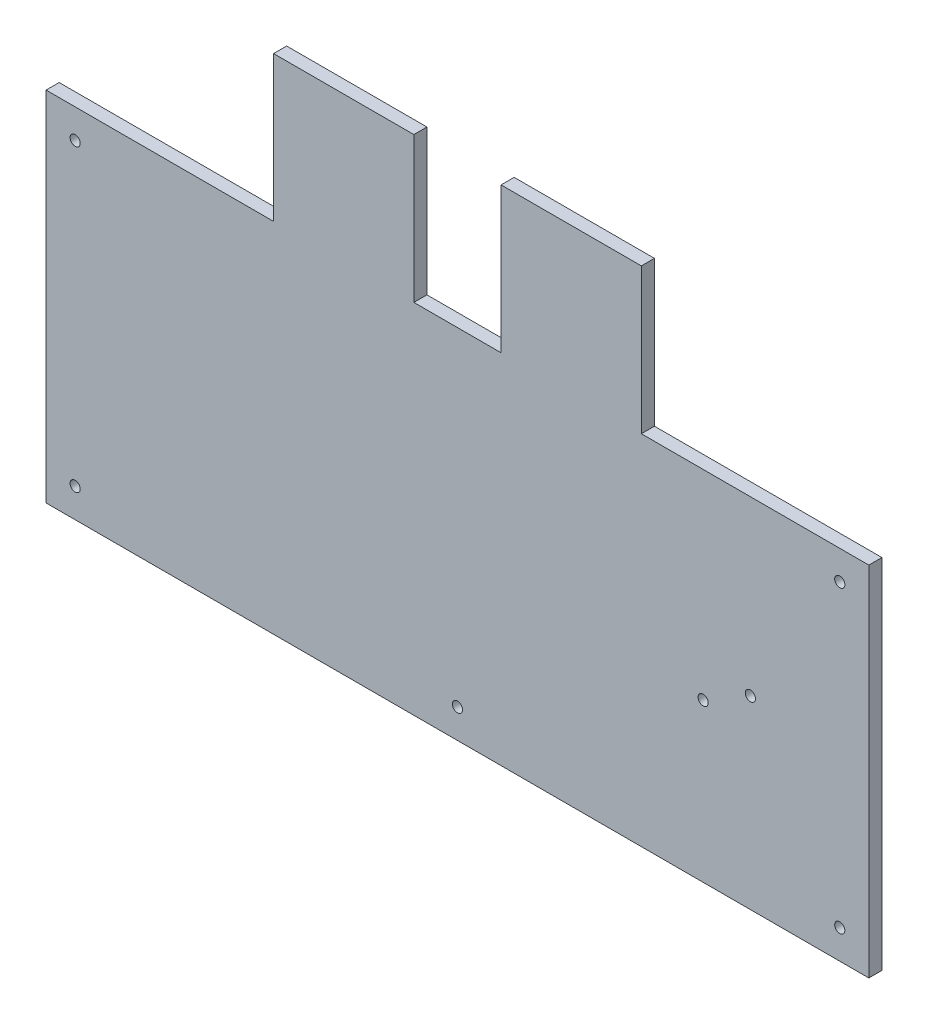
ISO-10303-21;
HEADER;
FILE_DESCRIPTION(('STEP AP214'),'2;1');
FILE_NAME('part.step','',(''),(''),'','','');
FILE_SCHEMA(('AUTOMOTIVE_DESIGN { 1 0 10303 214 1 1 1 1 }'));
ENDSEC;
DATA;
#1=APPLICATION_CONTEXT('core data for automotive mechanical design processes');
#2=APPLICATION_PROTOCOL_DEFINITION('international standard','automotive_design',2000,#1);
#3=PRODUCT_CONTEXT('',#1,'mechanical');
#4=PRODUCT('Part','Part','',(#3));
#5=PRODUCT_RELATED_PRODUCT_CATEGORY('part','',(#4));
#6=PRODUCT_DEFINITION_FORMATION('','',#4);
#7=PRODUCT_DEFINITION_CONTEXT('part definition',#1,'design');
#8=PRODUCT_DEFINITION('design','',#6,#7);
#9=PRODUCT_DEFINITION_SHAPE('','',#8);
#10=(LENGTH_UNIT() NAMED_UNIT(*) SI_UNIT(.MILLI.,.METRE.));
#11=(NAMED_UNIT(*) PLANE_ANGLE_UNIT() SI_UNIT($,.RADIAN.));
#12=(NAMED_UNIT(*) SI_UNIT($,.STERADIAN.) SOLID_ANGLE_UNIT());
#13=UNCERTAINTY_MEASURE_WITH_UNIT(LENGTH_MEASURE(1.E-05),#10,'distance_accuracy_value','');
#14=(GEOMETRIC_REPRESENTATION_CONTEXT(3) GLOBAL_UNCERTAINTY_ASSIGNED_CONTEXT((#13)) GLOBAL_UNIT_ASSIGNED_CONTEXT((#10,
#11,#12)) REPRESENTATION_CONTEXT('',''));
#15=CARTESIAN_POINT('',(0.,0.,0.));
#16=DIRECTION('',(0.,0.,1.));
#17=DIRECTION('',(1.,0.,0.));
#18=AXIS2_PLACEMENT_3D('',#15,#16,#17);
#19=CARTESIAN_POINT('',(0.,86.5,4.5));
#20=DIRECTION('',(0.,-1.,0.));
#21=DIRECTION('',(1.,0.,0.));
#22=AXIS2_PLACEMENT_3D('',#19,#20,#21);
#23=PLANE('',#22);
#24=DIRECTION('',(-1.,0.,0.));
#25=VECTOR('',#24,1.);
#26=CARTESIAN_POINT('',(0.,86.5,0.));
#27=LINE('',#26,#25);
#28=CARTESIAN_POINT('',(-15.,86.5,0.));
#29=VERTEX_POINT('',#28);
#30=CARTESIAN_POINT('',(-63.25,86.5,0.));
#31=VERTEX_POINT('',#30);
#32=EDGE_CURVE('E169',#29,#31,#27,.T.);
#33=ORIENTED_EDGE('',*,*,#32,.T.);
#34=DIRECTION('',(0.,0.,1.));
#35=VECTOR('',#34,1.);
#36=CARTESIAN_POINT('',(-63.25,86.5,-0.00100000000000013));
#37=LINE('',#36,#35);
#38=CARTESIAN_POINT('',(-63.25,86.5,4.5));
#39=VERTEX_POINT('',#38);
#40=EDGE_CURVE('E142',#31,#39,#37,.T.);
#41=ORIENTED_EDGE('',*,*,#40,.T.);
#42=DIRECTION('',(-1.,0.,0.));
#43=VECTOR('',#42,1.);
#44=CARTESIAN_POINT('',(0.,86.5,4.5));
#45=LINE('',#44,#43);
#46=CARTESIAN_POINT('',(-15.,86.5,4.5));
#47=VERTEX_POINT('',#46);
#48=EDGE_CURVE('E163',#47,#39,#45,.T.);
#49=ORIENTED_EDGE('',*,*,#48,.F.);
#50=DIRECTION('',(0.,0.,1.));
#51=VECTOR('',#50,1.);
#52=CARTESIAN_POINT('',(-15.,86.5,-0.00100000000000013));
#53=LINE('',#52,#51);
#54=EDGE_CURVE('E223',#29,#47,#53,.T.);
#55=ORIENTED_EDGE('',*,*,#54,.F.);
#56=EDGE_LOOP('',(#33,#41,#49,#55));
#57=FACE_BOUND('',#56,.T.);
#58=ADVANCED_FACE('F41',(#57),#23,.F.);
#59=CARTESIAN_POINT('',(-141.5,0.,4.5));
#60=DIRECTION('',(-1.,0.,0.));
#61=DIRECTION('',(0.,0.,1.));
#62=AXIS2_PLACEMENT_3D('',#59,#60,#61);
#63=PLANE('',#62);
#64=DIRECTION('',(0.,0.,1.));
#65=VECTOR('',#64,1.);
#66=CARTESIAN_POINT('',(-141.5,36.5,-0.00100000000000013));
#67=LINE('',#66,#65);
#68=CARTESIAN_POINT('',(-141.5,36.5,0.));
#69=VERTEX_POINT('',#68);
#70=CARTESIAN_POINT('',(-141.5,36.5,4.5));
#71=VERTEX_POINT('',#70);
#72=EDGE_CURVE('E135',#69,#71,#67,.T.);
#73=ORIENTED_EDGE('',*,*,#72,.F.);
#74=DIRECTION('',(0.,1.,0.));
#75=VECTOR('',#74,1.);
#76=CARTESIAN_POINT('',(-141.5,0.,0.));
#77=LINE('',#76,#75);
#78=CARTESIAN_POINT('',(-141.5,-86.5,0.));
#79=VERTEX_POINT('',#78);
#80=EDGE_CURVE('E141',#79,#69,#77,.T.);
#81=ORIENTED_EDGE('',*,*,#80,.F.);
#82=DIRECTION('',(0.,0.,-1.));
#83=VECTOR('',#82,1.);
#84=CARTESIAN_POINT('',(-141.5,-86.5,4.5));
#85=LINE('',#84,#83);
#86=CARTESIAN_POINT('',(-141.5,-86.5,4.5));
#87=VERTEX_POINT('',#86);
#88=EDGE_CURVE('E11',#87,#79,#85,.T.);
#89=ORIENTED_EDGE('',*,*,#88,.F.);
#90=DIRECTION('',(0.,1.,0.));
#91=VECTOR('',#90,1.);
#92=CARTESIAN_POINT('',(-141.5,0.,4.5));
#93=LINE('',#92,#91);
#94=EDGE_CURVE('E149',#87,#71,#93,.T.);
#95=ORIENTED_EDGE('',*,*,#94,.T.);
#96=EDGE_LOOP('',(#73,#81,#89,#95));
#97=FACE_BOUND('',#96,.T.);
#98=ADVANCED_FACE('F43',(#97),#63,.T.);
#99=CARTESIAN_POINT('',(0.,-86.5,4.5));
#100=DIRECTION('',(0.,-1.,0.));
#101=DIRECTION('',(1.,0.,0.));
#102=AXIS2_PLACEMENT_3D('',#99,#100,#101);
#103=PLANE('',#102);
#104=DIRECTION('',(-1.,0.,0.));
#105=VECTOR('',#104,1.);
#106=CARTESIAN_POINT('',(0.,-86.5,0.));
#107=LINE('',#106,#105);
#108=CARTESIAN_POINT('',(141.5,-86.5,0.));
#109=VERTEX_POINT('',#108);
#110=EDGE_CURVE('E156',#109,#79,#107,.T.);
#111=ORIENTED_EDGE('',*,*,#110,.F.);
#112=DIRECTION('',(0.,0.,-1.));
#113=VECTOR('',#112,1.);
#114=CARTESIAN_POINT('',(141.5,-86.5,4.5));
#115=LINE('',#114,#113);
#116=CARTESIAN_POINT('',(141.5,-86.5,4.5));
#117=VERTEX_POINT('',#116);
#118=EDGE_CURVE('E51',#117,#109,#115,.T.);
#119=ORIENTED_EDGE('',*,*,#118,.F.);
#120=DIRECTION('',(-1.,0.,0.));
#121=VECTOR('',#120,1.);
#122=CARTESIAN_POINT('',(0.,-86.5,4.5));
#123=LINE('',#122,#121);
#124=EDGE_CURVE('E241',#117,#87,#123,.T.);
#125=ORIENTED_EDGE('',*,*,#124,.T.);
#126=ORIENTED_EDGE('',*,*,#88,.T.);
#127=EDGE_LOOP('',(#111,#119,#125,#126));
#128=FACE_BOUND('',#127,.T.);
#129=ADVANCED_FACE('F387',(#128),#103,.T.);
#130=CARTESIAN_POINT('',(141.5,0.,4.5));
#131=DIRECTION('',(-1.,0.,0.));
#132=DIRECTION('',(0.,0.,1.));
#133=AXIS2_PLACEMENT_3D('',#130,#131,#132);
#134=PLANE('',#133);
#135=DIRECTION('',(0.,1.,0.));
#136=VECTOR('',#135,1.);
#137=CARTESIAN_POINT('',(141.5,0.,0.));
#138=LINE('',#137,#136);
#139=CARTESIAN_POINT('',(141.5,36.5,0.));
#140=VERTEX_POINT('',#139);
#141=EDGE_CURVE('E160',#109,#140,#138,.T.);
#142=ORIENTED_EDGE('',*,*,#141,.T.);
#143=DIRECTION('',(0.,0.,1.));
#144=VECTOR('',#143,1.);
#145=CARTESIAN_POINT('',(141.5,36.5,-0.00100000000000013));
#146=LINE('',#145,#144);
#147=CARTESIAN_POINT('',(141.5,36.5,4.5));
#148=VERTEX_POINT('',#147);
#149=EDGE_CURVE('E296',#140,#148,#146,.T.);
#150=ORIENTED_EDGE('',*,*,#149,.T.);
#151=DIRECTION('',(0.,1.,0.));
#152=VECTOR('',#151,1.);
#153=CARTESIAN_POINT('',(141.5,0.,4.5));
#154=LINE('',#153,#152);
#155=EDGE_CURVE('E244',#117,#148,#154,.T.);
#156=ORIENTED_EDGE('',*,*,#155,.F.);
#157=ORIENTED_EDGE('',*,*,#118,.T.);
#158=EDGE_LOOP('',(#142,#150,#156,#157));
#159=FACE_BOUND('',#158,.T.);
#160=ADVANCED_FACE('F390',(#159),#134,.F.);
#161=CARTESIAN_POINT('',(63.25,86.5,4.5));
#162=VERTEX_POINT('',#161);
#163=CARTESIAN_POINT('',(15.,86.5,4.5));
#164=VERTEX_POINT('',#163);
#165=EDGE_CURVE('E175',#162,#164,#45,.T.);
#166=ORIENTED_EDGE('',*,*,#165,.F.);
#167=DIRECTION('',(0.,0.,1.));
#168=VECTOR('',#167,1.);
#169=CARTESIAN_POINT('',(63.25,86.5,-0.00100000000000013));
#170=LINE('',#169,#168);
#171=CARTESIAN_POINT('',(63.25,86.5,0.));
#172=VERTEX_POINT('',#171);
#173=EDGE_CURVE('E269',#172,#162,#170,.T.);
#174=ORIENTED_EDGE('',*,*,#173,.F.);
#175=CARTESIAN_POINT('',(15.,86.5,0.));
#176=VERTEX_POINT('',#175);
#177=EDGE_CURVE('E173',#172,#176,#27,.T.);
#178=ORIENTED_EDGE('',*,*,#177,.T.);
#179=DIRECTION('',(0.,0.,1.));
#180=VECTOR('',#179,1.);
#181=CARTESIAN_POINT('',(15.,86.5,-0.00100000000000013));
#182=LINE('',#181,#180);
#183=EDGE_CURVE('E227',#176,#164,#182,.T.);
#184=ORIENTED_EDGE('',*,*,#183,.T.);
#185=EDGE_LOOP('',(#166,#174,#178,#184));
#186=FACE_BOUND('',#185,.T.);
#187=ADVANCED_FACE('F267',(#186),#23,.F.);
#188=CARTESIAN_POINT('',(0.,0.,4.5));
#189=DIRECTION('',(0.,0.,1.));
#190=DIRECTION('',(1.,0.,0.));
#191=AXIS2_PLACEMENT_3D('',#188,#189,#190);
#192=PLANE('',#191);
#193=CARTESIAN_POINT('',(84.5120236790417,-32.2,4.5));
#194=DIRECTION('',(0.,0.,1.));
#195=DIRECTION('',(1.,0.,0.));
#196=AXIS2_PLACEMENT_3D('',#193,#194,#195);
#197=CIRCLE('',#196,1.75);
#198=CARTESIAN_POINT('',(86.2620236790417,-32.2,4.5));
#199=VERTEX_POINT('',#198);
#200=EDGE_CURVE('E335',#199,#199,#197,.T.);
#201=ORIENTED_EDGE('',*,*,#200,.F.);
#202=EDGE_LOOP('',(#201));
#203=FACE_BOUND('',#202,.T.);
#204=CARTESIAN_POINT('',(100.75,-22.8250000000001,4.5));
#205=DIRECTION('',(0.,0.,1.));
#206=DIRECTION('',(1.,0.,0.));
#207=AXIS2_PLACEMENT_3D('',#204,#205,#206);
#208=CIRCLE('',#207,1.75);
#209=CARTESIAN_POINT('',(102.5,-22.8250000000001,4.5));
#210=VERTEX_POINT('',#209);
#211=EDGE_CURVE('E336',#210,#210,#208,.T.);
#212=ORIENTED_EDGE('',*,*,#211,.F.);
#213=EDGE_LOOP('',(#212));
#214=FACE_BOUND('',#213,.T.);
#215=CARTESIAN_POINT('',(0.,-76.5,4.5));
#216=DIRECTION('',(0.,0.,1.));
#217=DIRECTION('',(1.,0.,0.));
#218=AXIS2_PLACEMENT_3D('',#215,#216,#217);
#219=CIRCLE('',#218,1.75);
#220=CARTESIAN_POINT('',(1.75,-76.5,4.5));
#221=VERTEX_POINT('',#220);
#222=EDGE_CURVE('E315',#221,#221,#219,.T.);
#223=ORIENTED_EDGE('',*,*,#222,.F.);
#224=EDGE_LOOP('',(#223));
#225=FACE_BOUND('',#224,.T.);
#226=CARTESIAN_POINT('',(-131.5,26.5,4.5));
#227=DIRECTION('',(0.,0.,1.));
#228=DIRECTION('',(-1.,0.,0.));
#229=AXIS2_PLACEMENT_3D('',#226,#227,#228);
#230=CIRCLE('',#229,1.75000000000001);
#231=CARTESIAN_POINT('',(-133.25,26.5,4.5));
#232=VERTEX_POINT('',#231);
#233=EDGE_CURVE('E319',#232,#232,#230,.T.);
#234=ORIENTED_EDGE('',*,*,#233,.F.);
#235=EDGE_LOOP('',(#234));
#236=FACE_BOUND('',#235,.T.);
#237=CARTESIAN_POINT('',(131.5,26.5,4.5));
#238=DIRECTION('',(0.,0.,1.));
#239=DIRECTION('',(1.,0.,0.));
#240=AXIS2_PLACEMENT_3D('',#237,#238,#239);
#241=CIRCLE('',#240,1.75000000000001);
#242=CARTESIAN_POINT('',(133.25,26.5,4.5));
#243=VERTEX_POINT('',#242);
#244=EDGE_CURVE('E324',#243,#243,#241,.T.);
#245=ORIENTED_EDGE('',*,*,#244,.F.);
#246=EDGE_LOOP('',(#245));
#247=FACE_BOUND('',#246,.T.);
#248=CARTESIAN_POINT('',(131.5,-76.5,4.5));
#249=DIRECTION('',(0.,0.,1.));
#250=DIRECTION('',(-1.,0.,0.));
#251=AXIS2_PLACEMENT_3D('',#248,#249,#250);
#252=CIRCLE('',#251,1.75000000000001);
#253=CARTESIAN_POINT('',(129.75,-76.5,4.5));
#254=VERTEX_POINT('',#253);
#255=EDGE_CURVE('E314',#254,#254,#252,.T.);
#256=ORIENTED_EDGE('',*,*,#255,.F.);
#257=EDGE_LOOP('',(#256));
#258=FACE_BOUND('',#257,.T.);
#259=CARTESIAN_POINT('',(-131.5,-76.5,4.5));
#260=DIRECTION('',(0.,0.,1.));
#261=DIRECTION('',(1.,0.,0.));
#262=AXIS2_PLACEMENT_3D('',#259,#260,#261);
#263=CIRCLE('',#262,1.75000000000001);
#264=CARTESIAN_POINT('',(-129.75,-76.5,4.5));
#265=VERTEX_POINT('',#264);
#266=EDGE_CURVE('E182',#265,#265,#263,.T.);
#267=ORIENTED_EDGE('',*,*,#266,.F.);
#268=EDGE_LOOP('',(#267));
#269=FACE_BOUND('',#268,.T.);
#270=DIRECTION('',(0.,1.,0.));
#271=VECTOR('',#270,1.);
#272=CARTESIAN_POINT('',(-63.25,86.5,4.5));
#273=LINE('',#272,#271);
#274=CARTESIAN_POINT('',(-63.25,36.5,4.5));
#275=VERTEX_POINT('',#274);
#276=EDGE_CURVE('E151',#275,#39,#273,.T.);
#277=ORIENTED_EDGE('',*,*,#276,.F.);
#278=DIRECTION('',(1.,0.,0.));
#279=VECTOR('',#278,1.);
#280=CARTESIAN_POINT('',(-141.5,36.5,4.5));
#281=LINE('',#280,#279);
#282=EDGE_CURVE('E307',#71,#275,#281,.T.);
#283=ORIENTED_EDGE('',*,*,#282,.F.);
#284=ORIENTED_EDGE('',*,*,#94,.F.);
#285=ORIENTED_EDGE('',*,*,#124,.F.);
#286=ORIENTED_EDGE('',*,*,#155,.T.);
#287=DIRECTION('',(1.,0.,0.));
#288=VECTOR('',#287,1.);
#289=CARTESIAN_POINT('',(141.5,36.5,4.5));
#290=LINE('',#289,#288);
#291=CARTESIAN_POINT('',(63.25,36.5,4.5));
#292=VERTEX_POINT('',#291);
#293=EDGE_CURVE('E293',#292,#148,#290,.T.);
#294=ORIENTED_EDGE('',*,*,#293,.F.);
#295=DIRECTION('',(0.,-1.,0.));
#296=VECTOR('',#295,1.);
#297=CARTESIAN_POINT('',(63.25,86.5,4.5));
#298=LINE('',#297,#296);
#299=EDGE_CURVE('E264',#162,#292,#298,.T.);
#300=ORIENTED_EDGE('',*,*,#299,.F.);
#301=ORIENTED_EDGE('',*,*,#165,.T.);
#302=DIRECTION('',(0.,1.,0.));
#303=VECTOR('',#302,1.);
#304=CARTESIAN_POINT('',(15.,36.5,4.5));
#305=LINE('',#304,#303);
#306=CARTESIAN_POINT('',(15.,36.5,4.5));
#307=VERTEX_POINT('',#306);
#308=EDGE_CURVE('E219',#307,#164,#305,.T.);
#309=ORIENTED_EDGE('',*,*,#308,.F.);
#310=DIRECTION('',(1.,0.,0.));
#311=VECTOR('',#310,1.);
#312=CARTESIAN_POINT('',(15.,36.5,4.5));
#313=LINE('',#312,#311);
#314=CARTESIAN_POINT('',(-15.,36.5,4.5));
#315=VERTEX_POINT('',#314);
#316=EDGE_CURVE('E215',#315,#307,#313,.T.);
#317=ORIENTED_EDGE('',*,*,#316,.F.);
#318=DIRECTION('',(0.,-1.,0.));
#319=VECTOR('',#318,1.);
#320=CARTESIAN_POINT('',(-15.,36.5,4.5));
#321=LINE('',#320,#319);
#322=EDGE_CURVE('E206',#47,#315,#321,.T.);
#323=ORIENTED_EDGE('',*,*,#322,.F.);
#324=ORIENTED_EDGE('',*,*,#48,.T.);
#325=EDGE_LOOP('',(#277,#283,#284,#285,#286,#294,#300,#301,#309,#317,#323,#324));
#326=FACE_BOUND('',#325,.T.);
#327=ADVANCED_FACE('F261',(#203,#214,#225,#236,#247,#258,#269,#326),#192,.T.);
#328=CARTESIAN_POINT('',(0.,0.,0.));
#329=DIRECTION('',(0.,0.,1.));
#330=DIRECTION('',(1.,0.,0.));
#331=AXIS2_PLACEMENT_3D('',#328,#329,#330);
#332=PLANE('',#331);
#333=CARTESIAN_POINT('',(84.5120236790417,-32.2,0.));
#334=DIRECTION('',(0.,0.,1.));
#335=DIRECTION('',(1.,0.,0.));
#336=AXIS2_PLACEMENT_3D('',#333,#334,#335);
#337=CIRCLE('',#336,1.75);
#338=CARTESIAN_POINT('',(86.2620236790417,-32.2,0.));
#339=VERTEX_POINT('',#338);
#340=EDGE_CURVE('E320',#339,#339,#337,.F.);
#341=ORIENTED_EDGE('',*,*,#340,.F.);
#342=EDGE_LOOP('',(#341));
#343=FACE_BOUND('',#342,.T.);
#344=CARTESIAN_POINT('',(100.75,-22.8250000000001,0.));
#345=DIRECTION('',(0.,0.,1.));
#346=DIRECTION('',(1.,0.,0.));
#347=AXIS2_PLACEMENT_3D('',#344,#345,#346);
#348=CIRCLE('',#347,1.75);
#349=CARTESIAN_POINT('',(102.5,-22.8250000000001,0.));
#350=VERTEX_POINT('',#349);
#351=EDGE_CURVE('E331',#350,#350,#348,.F.);
#352=ORIENTED_EDGE('',*,*,#351,.F.);
#353=EDGE_LOOP('',(#352));
#354=FACE_BOUND('',#353,.T.);
#355=CARTESIAN_POINT('',(0.,-76.5,0.));
#356=DIRECTION('',(0.,0.,1.));
#357=DIRECTION('',(1.,0.,0.));
#358=AXIS2_PLACEMENT_3D('',#355,#356,#357);
#359=CIRCLE('',#358,1.75);
#360=CARTESIAN_POINT('',(1.75,-76.5,0.));
#361=VERTEX_POINT('',#360);
#362=EDGE_CURVE('E45',#361,#361,#359,.T.);
#363=ORIENTED_EDGE('',*,*,#362,.T.);
#364=EDGE_LOOP('',(#363));
#365=FACE_BOUND('',#364,.T.);
#366=CARTESIAN_POINT('',(-131.5,26.5,0.));
#367=DIRECTION('',(0.,0.,1.));
#368=DIRECTION('',(1.,0.,0.));
#369=AXIS2_PLACEMENT_3D('',#366,#367,#368);
#370=CIRCLE('',#369,1.75000000000001);
#371=CARTESIAN_POINT('',(-129.75,26.5,0.));
#372=VERTEX_POINT('',#371);
#373=EDGE_CURVE('E189',#372,#372,#370,.T.);
#374=ORIENTED_EDGE('',*,*,#373,.T.);
#375=EDGE_LOOP('',(#374));
#376=FACE_BOUND('',#375,.T.);
#377=CARTESIAN_POINT('',(131.5,26.5,0.));
#378=DIRECTION('',(0.,0.,1.));
#379=DIRECTION('',(1.,0.,0.));
#380=AXIS2_PLACEMENT_3D('',#377,#378,#379);
#381=CIRCLE('',#380,1.75000000000001);
#382=CARTESIAN_POINT('',(133.25,26.5,0.));
#383=VERTEX_POINT('',#382);
#384=EDGE_CURVE('E186',#383,#383,#381,.T.);
#385=ORIENTED_EDGE('',*,*,#384,.T.);
#386=EDGE_LOOP('',(#385));
#387=FACE_BOUND('',#386,.T.);
#388=CARTESIAN_POINT('',(131.5,-76.5,0.));
#389=DIRECTION('',(0.,0.,1.));
#390=DIRECTION('',(1.,0.,0.));
#391=AXIS2_PLACEMENT_3D('',#388,#389,#390);
#392=CIRCLE('',#391,1.75000000000001);
#393=CARTESIAN_POINT('',(133.25,-76.5,0.));
#394=VERTEX_POINT('',#393);
#395=EDGE_CURVE('E181',#394,#394,#392,.T.);
#396=ORIENTED_EDGE('',*,*,#395,.T.);
#397=EDGE_LOOP('',(#396));
#398=FACE_BOUND('',#397,.T.);
#399=CARTESIAN_POINT('',(-131.5,-76.5,0.));
#400=DIRECTION('',(0.,0.,1.));
#401=DIRECTION('',(1.,0.,0.));
#402=AXIS2_PLACEMENT_3D('',#399,#400,#401);
#403=CIRCLE('',#402,1.75000000000001);
#404=CARTESIAN_POINT('',(-129.75,-76.5,0.));
#405=VERTEX_POINT('',#404);
#406=EDGE_CURVE('E177',#405,#405,#403,.T.);
#407=ORIENTED_EDGE('',*,*,#406,.T.);
#408=EDGE_LOOP('',(#407));
#409=FACE_BOUND('',#408,.T.);
#410=DIRECTION('',(-1.,0.,0.));
#411=VECTOR('',#410,1.);
#412=CARTESIAN_POINT('',(-141.5,36.5,0.));
#413=LINE('',#412,#411);
#414=CARTESIAN_POINT('',(-63.25,36.5,0.));
#415=VERTEX_POINT('',#414);
#416=EDGE_CURVE('E131',#415,#69,#413,.T.);
#417=ORIENTED_EDGE('',*,*,#416,.F.);
#418=DIRECTION('',(0.,-1.,0.));
#419=VECTOR('',#418,1.);
#420=CARTESIAN_POINT('',(-63.25,86.5,0.));
#421=LINE('',#420,#419);
#422=EDGE_CURVE('E59',#31,#415,#421,.T.);
#423=ORIENTED_EDGE('',*,*,#422,.F.);
#424=ORIENTED_EDGE('',*,*,#32,.F.);
#425=DIRECTION('',(0.,1.,0.));
#426=VECTOR('',#425,1.);
#427=CARTESIAN_POINT('',(-15.,36.5,0.));
#428=LINE('',#427,#426);
#429=CARTESIAN_POINT('',(-15.,36.5,0.));
#430=VERTEX_POINT('',#429);
#431=EDGE_CURVE('E200',#430,#29,#428,.T.);
#432=ORIENTED_EDGE('',*,*,#431,.F.);
#433=DIRECTION('',(-1.,0.,0.));
#434=VECTOR('',#433,1.);
#435=CARTESIAN_POINT('',(15.,36.5,0.));
#436=LINE('',#435,#434);
#437=CARTESIAN_POINT('',(15.,36.5,0.));
#438=VERTEX_POINT('',#437);
#439=EDGE_CURVE('E226',#438,#430,#436,.T.);
#440=ORIENTED_EDGE('',*,*,#439,.F.);
#441=DIRECTION('',(0.,-1.,0.));
#442=VECTOR('',#441,1.);
#443=CARTESIAN_POINT('',(15.,36.5,0.));
#444=LINE('',#443,#442);
#445=EDGE_CURVE('E196',#176,#438,#444,.T.);
#446=ORIENTED_EDGE('',*,*,#445,.F.);
#447=ORIENTED_EDGE('',*,*,#177,.F.);
#448=DIRECTION('',(0.,1.,0.));
#449=VECTOR('',#448,1.);
#450=CARTESIAN_POINT('',(63.25,86.5,0.));
#451=LINE('',#450,#449);
#452=CARTESIAN_POINT('',(63.25,36.5,0.));
#453=VERTEX_POINT('',#452);
#454=EDGE_CURVE('E209',#453,#172,#451,.T.);
#455=ORIENTED_EDGE('',*,*,#454,.F.);
#456=DIRECTION('',(-1.,0.,0.));
#457=VECTOR('',#456,1.);
#458=CARTESIAN_POINT('',(141.5,36.5,0.));
#459=LINE('',#458,#457);
#460=EDGE_CURVE('E67',#140,#453,#459,.T.);
#461=ORIENTED_EDGE('',*,*,#460,.F.);
#462=ORIENTED_EDGE('',*,*,#141,.F.);
#463=ORIENTED_EDGE('',*,*,#110,.T.);
#464=ORIENTED_EDGE('',*,*,#80,.T.);
#465=EDGE_LOOP('',(#417,#423,#424,#432,#440,#446,#447,#455,#461,#462,#463,#464));
#466=FACE_BOUND('',#465,.T.);
#467=ADVANCED_FACE('F153',(#343,#354,#365,#376,#387,#398,#409,#466),#332,.F.);
#468=CARTESIAN_POINT('',(-15.,36.5,-0.00100000000000013));
#469=DIRECTION('',(-1.,0.,0.));
#470=DIRECTION('',(0.,0.,1.));
#471=AXIS2_PLACEMENT_3D('',#468,#469,#470);
#472=PLANE('',#471);
#473=ORIENTED_EDGE('',*,*,#431,.T.);
#474=ORIENTED_EDGE('',*,*,#54,.T.);
#475=ORIENTED_EDGE('',*,*,#322,.T.);
#476=DIRECTION('',(0.,0.,1.));
#477=VECTOR('',#476,1.);
#478=CARTESIAN_POINT('',(-15.,36.5,-0.00100000000000013));
#479=LINE('',#478,#477);
#480=EDGE_CURVE('E222',#430,#315,#479,.T.);
#481=ORIENTED_EDGE('',*,*,#480,.F.);
#482=EDGE_LOOP('',(#473,#474,#475,#481));
#483=FACE_BOUND('',#482,.T.);
#484=ADVANCED_FACE('F373',(#483),#472,.F.);
#485=CARTESIAN_POINT('',(15.,36.5,-0.00100000000000013));
#486=DIRECTION('',(1.,0.,0.));
#487=DIRECTION('',(0.,1.,0.));
#488=AXIS2_PLACEMENT_3D('',#485,#486,#487);
#489=PLANE('',#488);
#490=ORIENTED_EDGE('',*,*,#445,.T.);
#491=DIRECTION('',(0.,0.,1.));
#492=VECTOR('',#491,1.);
#493=CARTESIAN_POINT('',(15.,36.5,-0.00100000000000013));
#494=LINE('',#493,#492);
#495=EDGE_CURVE('E231',#438,#307,#494,.T.);
#496=ORIENTED_EDGE('',*,*,#495,.T.);
#497=ORIENTED_EDGE('',*,*,#308,.T.);
#498=ORIENTED_EDGE('',*,*,#183,.F.);
#499=EDGE_LOOP('',(#490,#496,#497,#498));
#500=FACE_BOUND('',#499,.T.);
#501=ADVANCED_FACE('F271',(#500),#489,.F.);
#502=CARTESIAN_POINT('',(15.,36.5,-0.00100000000000013));
#503=DIRECTION('',(0.,-1.,0.));
#504=DIRECTION('',(0.,0.,-1.));
#505=AXIS2_PLACEMENT_3D('',#502,#503,#504);
#506=PLANE('',#505);
#507=ORIENTED_EDGE('',*,*,#439,.T.);
#508=ORIENTED_EDGE('',*,*,#480,.T.);
#509=ORIENTED_EDGE('',*,*,#316,.T.);
#510=ORIENTED_EDGE('',*,*,#495,.F.);
#511=EDGE_LOOP('',(#507,#508,#509,#510));
#512=FACE_BOUND('',#511,.T.);
#513=ADVANCED_FACE('F277',(#512),#506,.F.);
#514=CARTESIAN_POINT('',(141.5,36.5,-0.00100000000000013));
#515=DIRECTION('',(0.,-1.,0.));
#516=DIRECTION('',(0.,0.,-1.));
#517=AXIS2_PLACEMENT_3D('',#514,#515,#516);
#518=PLANE('',#517);
#519=ORIENTED_EDGE('',*,*,#460,.T.);
#520=DIRECTION('',(0.,0.,1.));
#521=VECTOR('',#520,1.);
#522=CARTESIAN_POINT('',(63.25,36.5,-0.00100000000000013));
#523=LINE('',#522,#521);
#524=EDGE_CURVE('E300',#453,#292,#523,.T.);
#525=ORIENTED_EDGE('',*,*,#524,.T.);
#526=ORIENTED_EDGE('',*,*,#293,.T.);
#527=ORIENTED_EDGE('',*,*,#149,.F.);
#528=EDGE_LOOP('',(#519,#525,#526,#527));
#529=FACE_BOUND('',#528,.T.);
#530=ADVANCED_FACE('F408',(#529),#518,.F.);
#531=CARTESIAN_POINT('',(63.25,86.5,-0.00100000000000013));
#532=DIRECTION('',(-1.,0.,0.));
#533=DIRECTION('',(0.,0.,1.));
#534=AXIS2_PLACEMENT_3D('',#531,#532,#533);
#535=PLANE('',#534);
#536=ORIENTED_EDGE('',*,*,#454,.T.);
#537=ORIENTED_EDGE('',*,*,#173,.T.);
#538=ORIENTED_EDGE('',*,*,#299,.T.);
#539=ORIENTED_EDGE('',*,*,#524,.F.);
#540=EDGE_LOOP('',(#536,#537,#538,#539));
#541=FACE_BOUND('',#540,.T.);
#542=ADVANCED_FACE('F304',(#541),#535,.F.);
#543=CARTESIAN_POINT('',(-63.25,86.5,-0.00100000000000013));
#544=DIRECTION('',(1.,0.,0.));
#545=DIRECTION('',(0.,0.,-1.));
#546=AXIS2_PLACEMENT_3D('',#543,#544,#545);
#547=PLANE('',#546);
#548=ORIENTED_EDGE('',*,*,#422,.T.);
#549=DIRECTION('',(0.,0.,1.));
#550=VECTOR('',#549,1.);
#551=CARTESIAN_POINT('',(-63.25,36.5,-0.00100000000000013));
#552=LINE('',#551,#550);
#553=EDGE_CURVE('E137',#415,#275,#552,.T.);
#554=ORIENTED_EDGE('',*,*,#553,.T.);
#555=ORIENTED_EDGE('',*,*,#276,.T.);
#556=ORIENTED_EDGE('',*,*,#40,.F.);
#557=EDGE_LOOP('',(#548,#554,#555,#556));
#558=FACE_BOUND('',#557,.T.);
#559=ADVANCED_FACE('F400',(#558),#547,.F.);
#560=CARTESIAN_POINT('',(-141.5,36.5,-0.00100000000000013));
#561=DIRECTION('',(0.,-1.,0.));
#562=DIRECTION('',(0.,0.,-1.));
#563=AXIS2_PLACEMENT_3D('',#560,#561,#562);
#564=PLANE('',#563);
#565=ORIENTED_EDGE('',*,*,#416,.T.);
#566=ORIENTED_EDGE('',*,*,#72,.T.);
#567=ORIENTED_EDGE('',*,*,#282,.T.);
#568=ORIENTED_EDGE('',*,*,#553,.F.);
#569=EDGE_LOOP('',(#565,#566,#567,#568));
#570=FACE_BOUND('',#569,.T.);
#571=ADVANCED_FACE('F133',(#570),#564,.F.);
#572=CARTESIAN_POINT('',(-131.5,-76.5,-5.5));
#573=DIRECTION('',(0.,0.,1.));
#574=DIRECTION('',(1.,0.,0.));
#575=AXIS2_PLACEMENT_3D('',#572,#573,#574);
#576=CYLINDRICAL_SURFACE('',#575,1.75000000000001);
#577=ORIENTED_EDGE('',*,*,#266,.T.);
#578=EDGE_LOOP('',(#577));
#579=FACE_BOUND('',#578,.T.);
#580=ORIENTED_EDGE('',*,*,#406,.F.);
#581=EDGE_LOOP('',(#580));
#582=FACE_BOUND('',#581,.T.);
#583=ADVANCED_FACE('F365',(#579,#582),#576,.F.);
#584=CARTESIAN_POINT('',(131.5,-76.5,-5.5));
#585=DIRECTION('',(0.,0.,1.));
#586=DIRECTION('',(1.,0.,0.));
#587=AXIS2_PLACEMENT_3D('',#584,#585,#586);
#588=CYLINDRICAL_SURFACE('',#587,1.75000000000001);
#589=ORIENTED_EDGE('',*,*,#255,.T.);
#590=EDGE_LOOP('',(#589));
#591=FACE_BOUND('',#590,.T.);
#592=ORIENTED_EDGE('',*,*,#395,.F.);
#593=EDGE_LOOP('',(#592));
#594=FACE_BOUND('',#593,.T.);
#595=ADVANCED_FACE('F368',(#591,#594),#588,.F.);
#596=CARTESIAN_POINT('',(131.5,26.5,-5.5));
#597=DIRECTION('',(0.,0.,1.));
#598=DIRECTION('',(1.,0.,0.));
#599=AXIS2_PLACEMENT_3D('',#596,#597,#598);
#600=CYLINDRICAL_SURFACE('',#599,1.75000000000001);
#601=ORIENTED_EDGE('',*,*,#244,.T.);
#602=EDGE_LOOP('',(#601));
#603=FACE_BOUND('',#602,.T.);
#604=ORIENTED_EDGE('',*,*,#384,.F.);
#605=EDGE_LOOP('',(#604));
#606=FACE_BOUND('',#605,.T.);
#607=ADVANCED_FACE('F454',(#603,#606),#600,.F.);
#608=CARTESIAN_POINT('',(-131.5,26.5,-5.5));
#609=DIRECTION('',(0.,0.,1.));
#610=DIRECTION('',(1.,0.,0.));
#611=AXIS2_PLACEMENT_3D('',#608,#609,#610);
#612=CYLINDRICAL_SURFACE('',#611,1.75000000000001);
#613=ORIENTED_EDGE('',*,*,#233,.T.);
#614=EDGE_LOOP('',(#613));
#615=FACE_BOUND('',#614,.T.);
#616=ORIENTED_EDGE('',*,*,#373,.F.);
#617=EDGE_LOOP('',(#616));
#618=FACE_BOUND('',#617,.T.);
#619=ADVANCED_FACE('F464',(#615,#618),#612,.F.);
#620=CARTESIAN_POINT('',(0.,-76.5,-5.5));
#621=DIRECTION('',(0.,0.,1.));
#622=DIRECTION('',(1.,0.,0.));
#623=AXIS2_PLACEMENT_3D('',#620,#621,#622);
#624=CYLINDRICAL_SURFACE('',#623,1.75);
#625=ORIENTED_EDGE('',*,*,#222,.T.);
#626=EDGE_LOOP('',(#625));
#627=FACE_BOUND('',#626,.T.);
#628=ORIENTED_EDGE('',*,*,#362,.F.);
#629=EDGE_LOOP('',(#628));
#630=FACE_BOUND('',#629,.T.);
#631=ADVANCED_FACE('F474',(#627,#630),#624,.F.);
#632=CARTESIAN_POINT('',(100.75,-22.8250000000001,-0.00100000000000013));
#633=DIRECTION('',(0.,0.,1.));
#634=DIRECTION('',(1.,0.,0.));
#635=AXIS2_PLACEMENT_3D('',#632,#633,#634);
#636=CYLINDRICAL_SURFACE('',#635,1.75);
#637=ORIENTED_EDGE('',*,*,#211,.T.);
#638=EDGE_LOOP('',(#637));
#639=FACE_BOUND('',#638,.T.);
#640=ORIENTED_EDGE('',*,*,#351,.T.);
#641=EDGE_LOOP('',(#640));
#642=FACE_BOUND('',#641,.T.);
#643=ADVANCED_FACE('F484',(#639,#642),#636,.F.);
#644=CARTESIAN_POINT('',(84.5120236790417,-32.2,-0.00100000000000013));
#645=DIRECTION('',(0.,0.,1.));
#646=DIRECTION('',(1.,0.,0.));
#647=AXIS2_PLACEMENT_3D('',#644,#645,#646);
#648=CYLINDRICAL_SURFACE('',#647,1.75);
#649=ORIENTED_EDGE('',*,*,#200,.T.);
#650=EDGE_LOOP('',(#649));
#651=FACE_BOUND('',#650,.T.);
#652=ORIENTED_EDGE('',*,*,#340,.T.);
#653=EDGE_LOOP('',(#652));
#654=FACE_BOUND('',#653,.T.);
#655=ADVANCED_FACE('F347',(#651,#654),#648,.F.);
#656=CLOSED_SHELL('',(#58,#98,#129,#160,#187,#327,#467,#484,#501,#513,#530,#542,#559,#571,#583,
#595,#607,#619,#631,#643,#655));
#657=MANIFOLD_SOLID_BREP('B2',#656);
#658=ADVANCED_BREP_SHAPE_REPRESENTATION('',(#18,#657),#14);
#659=SHAPE_DEFINITION_REPRESENTATION(#9,#658);
ENDSEC;
END-ISO-10303-21;
